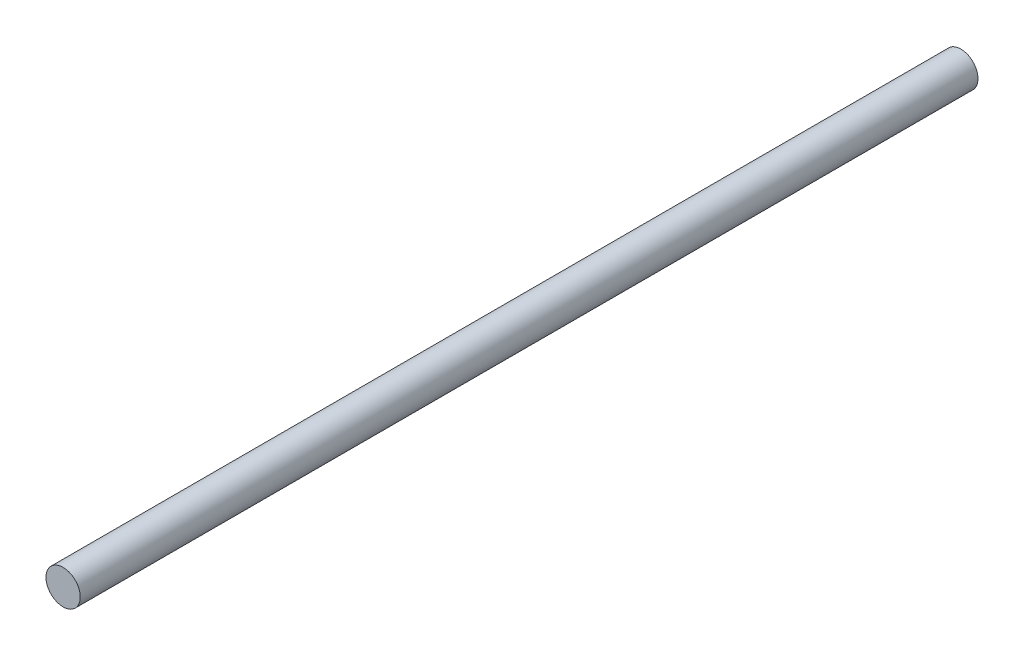
ISO-10303-21;
HEADER;
FILE_DESCRIPTION(('STEP AP214'),'2;1');
FILE_NAME('part.step','',(''),(''),'','','');
FILE_SCHEMA(('AUTOMOTIVE_DESIGN { 1 0 10303 214 1 1 1 1 }'));
ENDSEC;
DATA;
#1=APPLICATION_CONTEXT('core data for automotive mechanical design processes');
#2=APPLICATION_PROTOCOL_DEFINITION('international standard','automotive_design',2000,#1);
#3=PRODUCT_CONTEXT('',#1,'mechanical');
#4=PRODUCT('Part','Part','',(#3));
#5=PRODUCT_RELATED_PRODUCT_CATEGORY('part','',(#4));
#6=PRODUCT_DEFINITION_FORMATION('','',#4);
#7=PRODUCT_DEFINITION_CONTEXT('part definition',#1,'design');
#8=PRODUCT_DEFINITION('design','',#6,#7);
#9=PRODUCT_DEFINITION_SHAPE('','',#8);
#10=(LENGTH_UNIT() NAMED_UNIT(*) SI_UNIT(.MILLI.,.METRE.));
#11=(NAMED_UNIT(*) PLANE_ANGLE_UNIT() SI_UNIT($,.RADIAN.));
#12=(NAMED_UNIT(*) SI_UNIT($,.STERADIAN.) SOLID_ANGLE_UNIT());
#13=UNCERTAINTY_MEASURE_WITH_UNIT(LENGTH_MEASURE(1.E-05),#10,'distance_accuracy_value','');
#14=(GEOMETRIC_REPRESENTATION_CONTEXT(3) GLOBAL_UNCERTAINTY_ASSIGNED_CONTEXT((#13)) GLOBAL_UNIT_ASSIGNED_CONTEXT((#10,
#11,#12)) REPRESENTATION_CONTEXT('',''));
#15=CARTESIAN_POINT('',(0.,0.,0.));
#16=DIRECTION('',(0.,0.,1.));
#17=DIRECTION('',(1.,0.,0.));
#18=AXIS2_PLACEMENT_3D('',#15,#16,#17);
#19=CARTESIAN_POINT('',(0.,0.,26.2));
#20=DIRECTION('',(0.,0.,-1.));
#21=DIRECTION('',(-1.,0.,0.));
#22=AXIS2_PLACEMENT_3D('',#19,#20,#21);
#23=CYLINDRICAL_SURFACE('',#22,0.5);
#24=CARTESIAN_POINT('',(0.,0.,26.2));
#25=DIRECTION('',(0.,0.,1.));
#26=DIRECTION('',(1.,0.,0.));
#27=AXIS2_PLACEMENT_3D('',#24,#25,#26);
#28=CIRCLE('',#27,0.5);
#29=CARTESIAN_POINT('',(0.5,0.,26.2));
#30=VERTEX_POINT('',#29);
#31=EDGE_CURVE('E10',#30,#30,#28,.T.);
#32=ORIENTED_EDGE('',*,*,#31,.F.);
#33=EDGE_LOOP('',(#32));
#34=FACE_BOUND('',#33,.T.);
#35=CARTESIAN_POINT('',(0.,0.,0.));
#36=DIRECTION('',(0.,0.,1.));
#37=DIRECTION('',(1.,0.,0.));
#38=AXIS2_PLACEMENT_3D('',#35,#36,#37);
#39=CIRCLE('',#38,0.5);
#40=CARTESIAN_POINT('',(0.5,0.,0.));
#41=VERTEX_POINT('',#40);
#42=EDGE_CURVE('E34',#41,#41,#39,.T.);
#43=ORIENTED_EDGE('',*,*,#42,.T.);
#44=EDGE_LOOP('',(#43));
#45=FACE_BOUND('',#44,.T.);
#46=ADVANCED_FACE('F31',(#34,#45),#23,.T.);
#47=CARTESIAN_POINT('',(0.,0.,26.2));
#48=DIRECTION('',(0.,0.,1.));
#49=DIRECTION('',(1.,0.,0.));
#50=AXIS2_PLACEMENT_3D('',#47,#48,#49);
#51=PLANE('',#50);
#52=ORIENTED_EDGE('',*,*,#31,.T.);
#53=EDGE_LOOP('',(#52));
#54=FACE_BOUND('',#53,.T.);
#55=ADVANCED_FACE('F46',(#54),#51,.T.);
#56=CARTESIAN_POINT('',(0.,0.,0.));
#57=DIRECTION('',(0.,0.,1.));
#58=DIRECTION('',(1.,0.,0.));
#59=AXIS2_PLACEMENT_3D('',#56,#57,#58);
#60=PLANE('',#59);
#61=ORIENTED_EDGE('',*,*,#42,.F.);
#62=EDGE_LOOP('',(#61));
#63=FACE_BOUND('',#62,.T.);
#64=ADVANCED_FACE('F44',(#63),#60,.F.);
#65=CLOSED_SHELL('',(#46,#55,#64));
#66=MANIFOLD_SOLID_BREP('B2',#65);
#67=ADVANCED_BREP_SHAPE_REPRESENTATION('',(#18,#66),#14);
#68=SHAPE_DEFINITION_REPRESENTATION(#9,#67);
ENDSEC;
END-ISO-10303-21;
